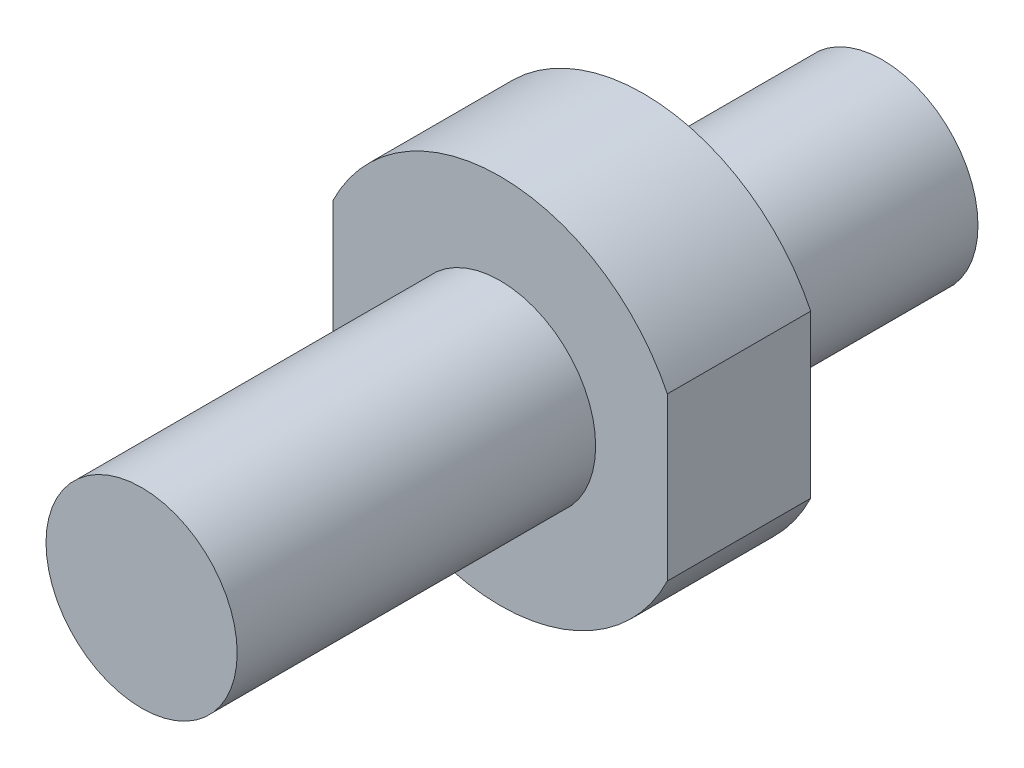
ISO-10303-21;
HEADER;
FILE_DESCRIPTION(('STEP AP214'),'2;1');
FILE_NAME('part.step','',(''),(''),'','','');
FILE_SCHEMA(('AUTOMOTIVE_DESIGN { 1 0 10303 214 1 1 1 1 }'));
ENDSEC;
DATA;
#1=APPLICATION_CONTEXT('core data for automotive mechanical design processes');
#2=APPLICATION_PROTOCOL_DEFINITION('international standard','automotive_design',2000,#1);
#3=PRODUCT_CONTEXT('',#1,'mechanical');
#4=PRODUCT('Part','Part','',(#3));
#5=PRODUCT_RELATED_PRODUCT_CATEGORY('part','',(#4));
#6=PRODUCT_DEFINITION_FORMATION('','',#4);
#7=PRODUCT_DEFINITION_CONTEXT('part definition',#1,'design');
#8=PRODUCT_DEFINITION('design','',#6,#7);
#9=PRODUCT_DEFINITION_SHAPE('','',#8);
#10=(LENGTH_UNIT() NAMED_UNIT(*) SI_UNIT(.MILLI.,.METRE.));
#11=(NAMED_UNIT(*) PLANE_ANGLE_UNIT() SI_UNIT($,.RADIAN.));
#12=(NAMED_UNIT(*) SI_UNIT($,.STERADIAN.) SOLID_ANGLE_UNIT());
#13=UNCERTAINTY_MEASURE_WITH_UNIT(LENGTH_MEASURE(1.E-05),#10,'distance_accuracy_value','');
#14=(GEOMETRIC_REPRESENTATION_CONTEXT(3) GLOBAL_UNCERTAINTY_ASSIGNED_CONTEXT((#13)) GLOBAL_UNIT_ASSIGNED_CONTEXT((#10,
#11,#12)) REPRESENTATION_CONTEXT('',''));
#15=CARTESIAN_POINT('',(0.,0.,0.));
#16=DIRECTION('',(0.,0.,1.));
#17=DIRECTION('',(1.,0.,0.));
#18=AXIS2_PLACEMENT_3D('',#15,#16,#17);
#19=CARTESIAN_POINT('',(0.,4.,-15.));
#20=DIRECTION('',(0.,0.,-1.));
#21=DIRECTION('',(-1.,0.,0.));
#22=AXIS2_PLACEMENT_3D('',#19,#20,#21);
#23=PLANE('',#22);
#24=CARTESIAN_POINT('',(0.,0.,-15.));
#25=DIRECTION('',(0.,0.,1.));
#26=DIRECTION('',(1.,0.,0.));
#27=AXIS2_PLACEMENT_3D('',#24,#25,#26);
#28=CIRCLE('',#27,4.);
#29=CARTESIAN_POINT('',(4.,0.,-15.));
#30=VERTEX_POINT('',#29);
#31=EDGE_CURVE('E107',#30,#30,#28,.T.);
#32=ORIENTED_EDGE('',*,*,#31,.F.);
#33=EDGE_LOOP('',(#32));
#34=FACE_BOUND('',#33,.T.);
#35=CARTESIAN_POINT('',(0.,0.,-15.));
#36=DIRECTION('',(0.,0.,-1.));
#37=DIRECTION('',(-1.,0.,0.));
#38=AXIS2_PLACEMENT_3D('',#35,#36,#37);
#39=CIRCLE('',#38,7.77784742024014);
#40=CARTESIAN_POINT('',(-7.,3.39041450158181,-15.));
#41=VERTEX_POINT('',#40);
#42=CARTESIAN_POINT('',(7.,3.39041450158181,-15.));
#43=VERTEX_POINT('',#42);
#44=EDGE_CURVE('E84',#41,#43,#39,.T.);
#45=ORIENTED_EDGE('',*,*,#44,.F.);
#46=DIRECTION('',(0.,1.,0.));
#47=VECTOR('',#46,1.);
#48=CARTESIAN_POINT('',(-7.,-8.43799237337698,-15.));
#49=LINE('',#48,#47);
#50=CARTESIAN_POINT('',(-7.,-3.39041450158181,-15.));
#51=VERTEX_POINT('',#50);
#52=EDGE_CURVE('E114',#51,#41,#49,.T.);
#53=ORIENTED_EDGE('',*,*,#52,.F.);
#54=CARTESIAN_POINT('',(7.,-3.39041450158181,-15.));
#55=VERTEX_POINT('',#54);
#56=EDGE_CURVE('E54',#55,#51,#39,.T.);
#57=ORIENTED_EDGE('',*,*,#56,.F.);
#58=DIRECTION('',(0.,-1.,0.));
#59=VECTOR('',#58,1.);
#60=CARTESIAN_POINT('',(7.,-8.43799237337698,-15.));
#61=LINE('',#60,#59);
#62=EDGE_CURVE('E115',#43,#55,#61,.T.);
#63=ORIENTED_EDGE('',*,*,#62,.F.);
#64=EDGE_LOOP('',(#45,#53,#57,#63));
#65=FACE_BOUND('',#64,.T.);
#66=ADVANCED_FACE('F40',(#34,#65),#23,.F.);
#67=CARTESIAN_POINT('',(0.,9.,-21.));
#68=DIRECTION('',(0.,0.,1.));
#69=DIRECTION('',(1.,0.,0.));
#70=AXIS2_PLACEMENT_3D('',#67,#68,#69);
#71=PLANE('',#70);
#72=CARTESIAN_POINT('',(0.,0.,-21.));
#73=DIRECTION('',(0.,0.,1.));
#74=DIRECTION('',(1.,0.,0.));
#75=AXIS2_PLACEMENT_3D('',#72,#73,#74);
#76=CIRCLE('',#75,4.);
#77=CARTESIAN_POINT('',(4.,0.,-21.));
#78=VERTEX_POINT('',#77);
#79=EDGE_CURVE('E129',#78,#78,#76,.T.);
#80=ORIENTED_EDGE('',*,*,#79,.T.);
#81=EDGE_LOOP('',(#80));
#82=FACE_BOUND('',#81,.T.);
#83=CARTESIAN_POINT('',(0.,0.,-21.));
#84=DIRECTION('',(0.,0.,-1.));
#85=DIRECTION('',(-1.,0.,0.));
#86=AXIS2_PLACEMENT_3D('',#83,#84,#85);
#87=CIRCLE('',#86,7.77784742024014);
#88=CARTESIAN_POINT('',(-7.,3.39041450158181,-21.));
#89=VERTEX_POINT('',#88);
#90=CARTESIAN_POINT('',(7.,3.39041450158181,-21.));
#91=VERTEX_POINT('',#90);
#92=EDGE_CURVE('E62',#89,#91,#87,.T.);
#93=ORIENTED_EDGE('',*,*,#92,.T.);
#94=DIRECTION('',(0.,-1.,0.));
#95=VECTOR('',#94,1.);
#96=CARTESIAN_POINT('',(7.,9.,-21.));
#97=LINE('',#96,#95);
#98=CARTESIAN_POINT('',(7.,-3.39041450158181,-21.));
#99=VERTEX_POINT('',#98);
#100=EDGE_CURVE('E95',#91,#99,#97,.T.);
#101=ORIENTED_EDGE('',*,*,#100,.T.);
#102=CARTESIAN_POINT('',(-7.,-3.39041450158181,-21.));
#103=VERTEX_POINT('',#102);
#104=EDGE_CURVE('E98',#99,#103,#87,.T.);
#105=ORIENTED_EDGE('',*,*,#104,.T.);
#106=DIRECTION('',(0.,1.,0.));
#107=VECTOR('',#106,1.);
#108=CARTESIAN_POINT('',(-7.,9.,-21.));
#109=LINE('',#108,#107);
#110=EDGE_CURVE('E97',#103,#89,#109,.T.);
#111=ORIENTED_EDGE('',*,*,#110,.T.);
#112=EDGE_LOOP('',(#93,#101,#105,#111));
#113=FACE_BOUND('',#112,.T.);
#114=ADVANCED_FACE('F93',(#82,#113),#71,.F.);
#115=CARTESIAN_POINT('',(7.,-8.43799237337698,-25.));
#116=DIRECTION('',(-1.,0.,0.));
#117=DIRECTION('',(0.,0.,1.));
#118=AXIS2_PLACEMENT_3D('',#115,#116,#117);
#119=PLANE('',#118);
#120=DIRECTION('',(0.,0.,-1.));
#121=VECTOR('',#120,1.);
#122=CARTESIAN_POINT('',(7.,3.39041450158181,-11.));
#123=LINE('',#122,#121);
#124=EDGE_CURVE('E81',#43,#91,#123,.T.);
#125=ORIENTED_EDGE('',*,*,#124,.F.);
#126=ORIENTED_EDGE('',*,*,#62,.T.);
#127=DIRECTION('',(0.,0.,-1.));
#128=VECTOR('',#127,1.);
#129=CARTESIAN_POINT('',(7.,-3.39041450158181,-11.));
#130=LINE('',#129,#128);
#131=EDGE_CURVE('E102',#99,#55,#130,.F.);
#132=ORIENTED_EDGE('',*,*,#131,.F.);
#133=ORIENTED_EDGE('',*,*,#100,.F.);
#134=EDGE_LOOP('',(#125,#126,#132,#133));
#135=FACE_BOUND('',#134,.T.);
#136=ADVANCED_FACE('F101',(#135),#119,.F.);
#137=CARTESIAN_POINT('',(-7.,-8.43799237337698,-25.));
#138=DIRECTION('',(1.,0.,0.));
#139=DIRECTION('',(0.,0.,-1.));
#140=AXIS2_PLACEMENT_3D('',#137,#138,#139);
#141=PLANE('',#140);
#142=DIRECTION('',(0.,0.,-1.));
#143=VECTOR('',#142,1.);
#144=CARTESIAN_POINT('',(-7.,-3.39041450158181,-11.));
#145=LINE('',#144,#143);
#146=EDGE_CURVE('E12',#51,#103,#145,.T.);
#147=ORIENTED_EDGE('',*,*,#146,.F.);
#148=ORIENTED_EDGE('',*,*,#52,.T.);
#149=DIRECTION('',(0.,0.,-1.));
#150=VECTOR('',#149,1.);
#151=CARTESIAN_POINT('',(-7.,3.39041450158181,-11.));
#152=LINE('',#151,#150);
#153=EDGE_CURVE('E48',#89,#41,#152,.F.);
#154=ORIENTED_EDGE('',*,*,#153,.F.);
#155=ORIENTED_EDGE('',*,*,#110,.F.);
#156=EDGE_LOOP('',(#147,#148,#154,#155));
#157=FACE_BOUND('',#156,.T.);
#158=ADVANCED_FACE('F117',(#157),#141,.F.);
#159=CARTESIAN_POINT('',(0.,0.,0.));
#160=DIRECTION('',(0.,0.,-1.));
#161=DIRECTION('',(-1.,0.,0.));
#162=AXIS2_PLACEMENT_3D('',#159,#160,#161);
#163=PLANE('',#162);
#164=CARTESIAN_POINT('',(0.,0.,0.));
#165=DIRECTION('',(0.,0.,1.));
#166=DIRECTION('',(1.,0.,0.));
#167=AXIS2_PLACEMENT_3D('',#164,#165,#166);
#168=CIRCLE('',#167,4.);
#169=CARTESIAN_POINT('',(4.,0.,0.));
#170=VERTEX_POINT('',#169);
#171=EDGE_CURVE('E103',#170,#170,#168,.T.);
#172=ORIENTED_EDGE('',*,*,#171,.T.);
#173=EDGE_LOOP('',(#172));
#174=FACE_BOUND('',#173,.T.);
#175=ADVANCED_FACE('F42',(#174),#163,.F.);
#176=CARTESIAN_POINT('',(0.,0.,0.));
#177=DIRECTION('',(0.,0.,1.));
#178=DIRECTION('',(1.,0.,0.));
#179=AXIS2_PLACEMENT_3D('',#176,#177,#178);
#180=CYLINDRICAL_SURFACE('',#179,4.);
#181=ORIENTED_EDGE('',*,*,#171,.F.);
#182=EDGE_LOOP('',(#181));
#183=FACE_BOUND('',#182,.T.);
#184=ORIENTED_EDGE('',*,*,#31,.T.);
#185=EDGE_LOOP('',(#184));
#186=FACE_BOUND('',#185,.T.);
#187=ADVANCED_FACE('F134',(#183,#186),#180,.T.);
#188=CARTESIAN_POINT('',(0.,0.,0.));
#189=DIRECTION('',(0.,0.,1.));
#190=DIRECTION('',(1.,0.,0.));
#191=AXIS2_PLACEMENT_3D('',#188,#189,#190);
#192=CYLINDRICAL_SURFACE('',#191,4.);
#193=ORIENTED_EDGE('',*,*,#79,.F.);
#194=EDGE_LOOP('',(#193));
#195=FACE_BOUND('',#194,.T.);
#196=CARTESIAN_POINT('',(0.,0.,-31.));
#197=DIRECTION('',(0.,0.,1.));
#198=DIRECTION('',(1.,0.,0.));
#199=AXIS2_PLACEMENT_3D('',#196,#197,#198);
#200=CIRCLE('',#199,4.);
#201=CARTESIAN_POINT('',(4.,0.,-31.));
#202=VERTEX_POINT('',#201);
#203=EDGE_CURVE('E120',#202,#202,#200,.T.);
#204=ORIENTED_EDGE('',*,*,#203,.T.);
#205=EDGE_LOOP('',(#204));
#206=FACE_BOUND('',#205,.T.);
#207=ADVANCED_FACE('F145',(#195,#206),#192,.T.);
#208=CARTESIAN_POINT('',(0.,4.,-31.));
#209=DIRECTION('',(0.,0.,1.));
#210=DIRECTION('',(1.,0.,0.));
#211=AXIS2_PLACEMENT_3D('',#208,#209,#210);
#212=PLANE('',#211);
#213=CARTESIAN_POINT('',(0.,0.,-31.));
#214=DIRECTION('',(0.,0.,-1.));
#215=DIRECTION('',(-1.,0.,0.));
#216=AXIS2_PLACEMENT_3D('',#213,#214,#215);
#217=CIRCLE('',#216,1.65);
#218=CARTESIAN_POINT('',(-1.65,0.,-31.));
#219=VERTEX_POINT('',#218);
#220=EDGE_CURVE('E123',#219,#219,#217,.T.);
#221=ORIENTED_EDGE('',*,*,#220,.F.);
#222=EDGE_LOOP('',(#221));
#223=FACE_BOUND('',#222,.T.);
#224=ORIENTED_EDGE('',*,*,#203,.F.);
#225=EDGE_LOOP('',(#224));
#226=FACE_BOUND('',#225,.T.);
#227=ADVANCED_FACE('F151',(#223,#226),#212,.F.);
#228=CARTESIAN_POINT('',(0.,0.,-19.5));
#229=DIRECTION('',(0.,0.,-1.));
#230=DIRECTION('',(-1.,0.,0.));
#231=AXIS2_PLACEMENT_3D('',#228,#229,#230);
#232=CONICAL_SURFACE('',#231,1.65,1.02974425867665);
#233=CARTESIAN_POINT('',(0.,0.,-18.5085799786045));
#234=VERTEX_POINT('',#233);
#235=VERTEX_LOOP('',#234);
#236=FACE_BOUND('',#235,.T.);
#237=CARTESIAN_POINT('',(0.,0.,-19.5));
#238=DIRECTION('',(0.,0.,-1.));
#239=DIRECTION('',(-1.,0.,0.));
#240=AXIS2_PLACEMENT_3D('',#237,#238,#239);
#241=CIRCLE('',#240,1.65);
#242=CARTESIAN_POINT('',(-1.65,0.,-19.5));
#243=VERTEX_POINT('',#242);
#244=EDGE_CURVE('E118',#243,#243,#241,.T.);
#245=ORIENTED_EDGE('',*,*,#244,.T.);
#246=EDGE_LOOP('',(#245));
#247=FACE_BOUND('',#246,.T.);
#248=ADVANCED_FACE('F164',(#236,#247),#232,.F.);
#249=CARTESIAN_POINT('',(0.,0.,-31.));
#250=DIRECTION('',(0.,0.,-1.));
#251=DIRECTION('',(-1.,0.,0.));
#252=AXIS2_PLACEMENT_3D('',#249,#250,#251);
#253=CYLINDRICAL_SURFACE('',#252,1.65);
#254=ORIENTED_EDGE('',*,*,#244,.F.);
#255=EDGE_LOOP('',(#254));
#256=FACE_BOUND('',#255,.T.);
#257=ORIENTED_EDGE('',*,*,#220,.T.);
#258=EDGE_LOOP('',(#257));
#259=FACE_BOUND('',#258,.T.);
#260=ADVANCED_FACE('F172',(#256,#259),#253,.F.);
#261=CARTESIAN_POINT('',(0.,0.,-11.));
#262=DIRECTION('',(0.,0.,-1.));
#263=DIRECTION('',(-1.,0.,0.));
#264=AXIS2_PLACEMENT_3D('',#261,#262,#263);
#265=CYLINDRICAL_SURFACE('',#264,7.77784742024014);
#266=ORIENTED_EDGE('',*,*,#124,.T.);
#267=ORIENTED_EDGE('',*,*,#92,.F.);
#268=ORIENTED_EDGE('',*,*,#153,.T.);
#269=ORIENTED_EDGE('',*,*,#44,.T.);
#270=EDGE_LOOP('',(#266,#267,#268,#269));
#271=FACE_BOUND('',#270,.T.);
#272=ADVANCED_FACE('F82',(#271),#265,.T.);
#273=ORIENTED_EDGE('',*,*,#131,.T.);
#274=ORIENTED_EDGE('',*,*,#56,.T.);
#275=ORIENTED_EDGE('',*,*,#146,.T.);
#276=ORIENTED_EDGE('',*,*,#104,.F.);
#277=EDGE_LOOP('',(#273,#274,#275,#276));
#278=FACE_BOUND('',#277,.T.);
#279=ADVANCED_FACE('F181',(#278),#265,.T.);
#280=CLOSED_SHELL('',(#66,#114,#136,#158,#175,#187,#207,#227,#248,#260,#272,#279));
#281=MANIFOLD_SOLID_BREP('B2',#280);
#282=ADVANCED_BREP_SHAPE_REPRESENTATION('',(#18,#281),#14);
#283=SHAPE_DEFINITION_REPRESENTATION(#9,#282);
ENDSEC;
END-ISO-10303-21;
